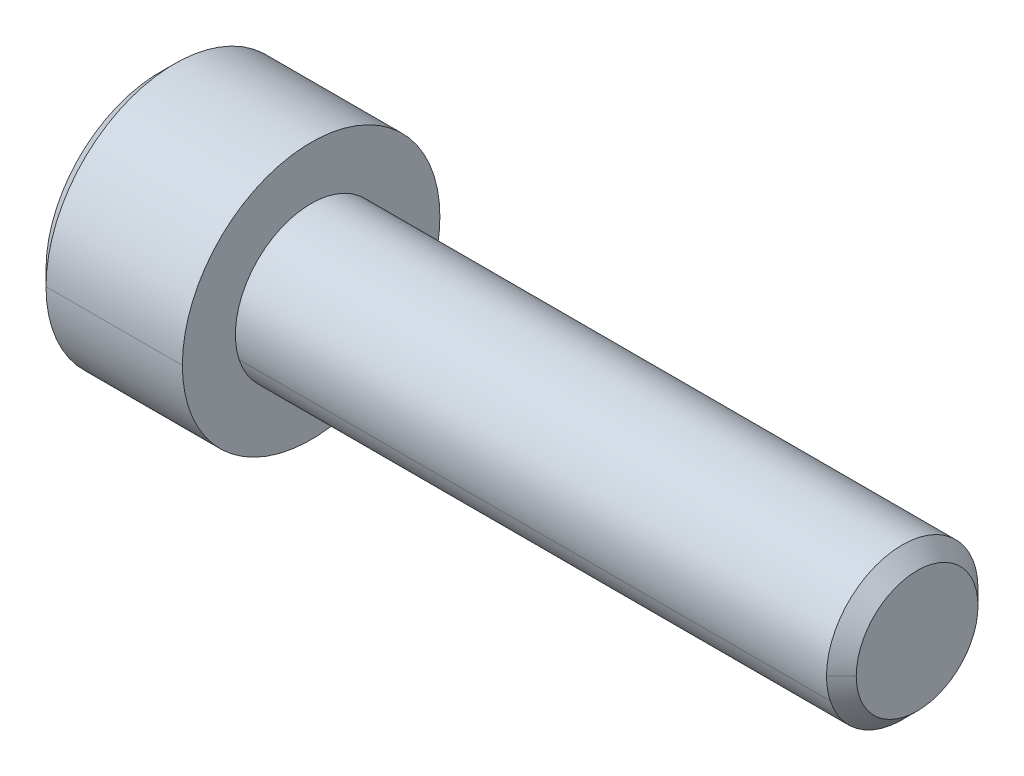
ISO-10303-21;
HEADER;
FILE_DESCRIPTION(('STEP AP214'),'2;1');
FILE_NAME('part.step','',(''),(''),'','','');
FILE_SCHEMA(('AUTOMOTIVE_DESIGN { 1 0 10303 214 1 1 1 1 }'));
ENDSEC;
DATA;
#1=APPLICATION_CONTEXT('core data for automotive mechanical design processes');
#2=APPLICATION_PROTOCOL_DEFINITION('international standard','automotive_design',2000,#1);
#3=PRODUCT_CONTEXT('',#1,'mechanical');
#4=PRODUCT('Part','Part','',(#3));
#5=PRODUCT_RELATED_PRODUCT_CATEGORY('part','',(#4));
#6=PRODUCT_DEFINITION_FORMATION('','',#4);
#7=PRODUCT_DEFINITION_CONTEXT('part definition',#1,'design');
#8=PRODUCT_DEFINITION('design','',#6,#7);
#9=PRODUCT_DEFINITION_SHAPE('','',#8);
#10=(LENGTH_UNIT() NAMED_UNIT(*) SI_UNIT(.MILLI.,.METRE.));
#11=(NAMED_UNIT(*) PLANE_ANGLE_UNIT() SI_UNIT($,.RADIAN.));
#12=(NAMED_UNIT(*) SI_UNIT($,.STERADIAN.) SOLID_ANGLE_UNIT());
#13=UNCERTAINTY_MEASURE_WITH_UNIT(LENGTH_MEASURE(1.E-05),#10,'distance_accuracy_value','');
#14=(GEOMETRIC_REPRESENTATION_CONTEXT(3) GLOBAL_UNCERTAINTY_ASSIGNED_CONTEXT((#13)) GLOBAL_UNIT_ASSIGNED_CONTEXT((#10,
#11,#12)) REPRESENTATION_CONTEXT('',''));
#15=CARTESIAN_POINT('',(0.,0.,0.));
#16=DIRECTION('',(0.,0.,1.));
#17=DIRECTION('',(1.,0.,0.));
#18=AXIS2_PLACEMENT_3D('',#15,#16,#17);
#19=CARTESIAN_POINT('',(-5.,0.,0.));
#20=DIRECTION('',(1.,0.,0.));
#21=DIRECTION('',(0.,0.,-1.));
#22=AXIS2_PLACEMENT_3D('',#19,#20,#21);
#23=PLANE('',#22);
#24=CARTESIAN_POINT('',(-5.,0.,0.));
#25=DIRECTION('',(1.,0.,0.));
#26=DIRECTION('',(0.,0.,-1.));
#27=AXIS2_PLACEMENT_3D('',#24,#25,#26);
#28=CIRCLE('',#27,3.75);
#29=CARTESIAN_POINT('',(-5.,0.,3.75));
#30=VERTEX_POINT('',#29);
#31=CARTESIAN_POINT('',(-5.,0.,-3.75));
#32=VERTEX_POINT('',#31);
#33=EDGE_CURVE('E11',#30,#32,#28,.T.);
#34=ORIENTED_EDGE('',*,*,#33,.F.);
#35=CARTESIAN_POINT('',(-5.,0.,0.));
#36=DIRECTION('',(1.,0.,0.));
#37=DIRECTION('',(0.,0.,-1.));
#38=AXIS2_PLACEMENT_3D('',#35,#36,#37);
#39=CIRCLE('',#38,3.75);
#40=EDGE_CURVE('E24',#32,#30,#39,.T.);
#41=ORIENTED_EDGE('',*,*,#40,.F.);
#42=EDGE_LOOP('',(#34,#41));
#43=FACE_BOUND('',#42,.T.);
#44=DIRECTION('',(0.,0.499999999999983,-0.866025403784448));
#45=VECTOR('',#44,1.);
#46=CARTESIAN_POINT('',(-5.,-2.3094010767585,0.));
#47=LINE('',#46,#45);
#48=CARTESIAN_POINT('',(-5.,-2.3094010767585,0.));
#49=VERTEX_POINT('',#48);
#50=CARTESIAN_POINT('',(-5.,-1.1547005383793,-2.));
#51=VERTEX_POINT('',#50);
#52=EDGE_CURVE('E360',#49,#51,#47,.T.);
#53=ORIENTED_EDGE('',*,*,#52,.T.);
#54=DIRECTION('',(0.,1.,0.));
#55=VECTOR('',#54,1.);
#56=CARTESIAN_POINT('',(-5.,-1.1547005383793,-2.));
#57=LINE('',#56,#55);
#58=CARTESIAN_POINT('',(-5.,1.1547005383793,-2.));
#59=VERTEX_POINT('',#58);
#60=EDGE_CURVE('E356',#51,#59,#57,.T.);
#61=ORIENTED_EDGE('',*,*,#60,.T.);
#62=DIRECTION('',(0.,0.499999999999983,0.866025403784448));
#63=VECTOR('',#62,1.);
#64=CARTESIAN_POINT('',(-5.,1.1547005383793,-2.));
#65=LINE('',#64,#63);
#66=CARTESIAN_POINT('',(-5.,2.3094010767585,0.));
#67=VERTEX_POINT('',#66);
#68=EDGE_CURVE('E352',#59,#67,#65,.T.);
#69=ORIENTED_EDGE('',*,*,#68,.T.);
#70=DIRECTION('',(0.,-0.499999999999983,0.866025403784448));
#71=VECTOR('',#70,1.);
#72=CARTESIAN_POINT('',(-5.,2.3094010767585,0.));
#73=LINE('',#72,#71);
#74=CARTESIAN_POINT('',(-5.,1.1547005383793,2.));
#75=VERTEX_POINT('',#74);
#76=EDGE_CURVE('E348',#67,#75,#73,.T.);
#77=ORIENTED_EDGE('',*,*,#76,.T.);
#78=DIRECTION('',(0.,-1.,0.));
#79=VECTOR('',#78,1.);
#80=CARTESIAN_POINT('',(-5.,1.1547005383793,2.));
#81=LINE('',#80,#79);
#82=CARTESIAN_POINT('',(-5.,-1.1547005383793,2.));
#83=VERTEX_POINT('',#82);
#84=EDGE_CURVE('E344',#75,#83,#81,.T.);
#85=ORIENTED_EDGE('',*,*,#84,.T.);
#86=DIRECTION('',(0.,-0.499999999999983,-0.866025403784448));
#87=VECTOR('',#86,1.);
#88=CARTESIAN_POINT('',(-5.,-1.1547005383793,2.));
#89=LINE('',#88,#87);
#90=EDGE_CURVE('E340',#83,#49,#89,.T.);
#91=ORIENTED_EDGE('',*,*,#90,.T.);
#92=EDGE_LOOP('',(#53,#61,#69,#77,#85,#91));
#93=FACE_BOUND('',#92,.T.);
#94=ADVANCED_FACE('F16',(#43,#93),#23,.F.);
#95=CARTESIAN_POINT('',(-2.5,-1.1547005383793,2.));
#96=DIRECTION('',(0.,0.866025403784448,-0.499999999999983));
#97=DIRECTION('',(0.,0.499999999999983,0.866025403784448));
#98=AXIS2_PLACEMENT_3D('',#95,#96,#97);
#99=PLANE('',#98);
#100=ORIENTED_EDGE('',*,*,#90,.F.);
#101=DIRECTION('',(-1.,0.,0.));
#102=VECTOR('',#101,1.);
#103=CARTESIAN_POINT('',(-2.5,-1.1547005383793,2.));
#104=LINE('',#103,#102);
#105=CARTESIAN_POINT('',(-2.5,-1.1547005383793,2.));
#106=VERTEX_POINT('',#105);
#107=EDGE_CURVE('E335',#106,#83,#104,.T.);
#108=ORIENTED_EDGE('',*,*,#107,.F.);
#109=DIRECTION('',(0.,-0.499999999999983,-0.866025403784448));
#110=VECTOR('',#109,1.);
#111=CARTESIAN_POINT('',(-2.5,-1.1547005383793,2.));
#112=LINE('',#111,#110);
#113=CARTESIAN_POINT('',(-2.5,-1.73205080756891,0.999999999999976));
#114=VERTEX_POINT('',#113);
#115=EDGE_CURVE('E331',#106,#114,#112,.T.);
#116=ORIENTED_EDGE('',*,*,#115,.T.);
#117=DIRECTION('',(0.,-0.499999999999983,-0.866025403784448));
#118=VECTOR('',#117,1.);
#119=CARTESIAN_POINT('',(-2.5,-1.1547005383793,2.));
#120=LINE('',#119,#118);
#121=CARTESIAN_POINT('',(-2.5,-2.3094010767585,0.));
#122=VERTEX_POINT('',#121);
#123=EDGE_CURVE('E327',#114,#122,#120,.T.);
#124=ORIENTED_EDGE('',*,*,#123,.T.);
#125=DIRECTION('',(-1.,0.,0.));
#126=VECTOR('',#125,1.);
#127=CARTESIAN_POINT('',(-2.5,-2.3094010767585,0.));
#128=LINE('',#127,#126);
#129=EDGE_CURVE('E322',#122,#49,#128,.T.);
#130=ORIENTED_EDGE('',*,*,#129,.T.);
#131=EDGE_LOOP('',(#100,#108,#116,#124,#130));
#132=FACE_BOUND('',#131,.T.);
#133=ADVANCED_FACE('F394',(#132),#99,.T.);
#134=CARTESIAN_POINT('',(-2.5,-2.3094010767585,0.));
#135=DIRECTION('',(0.,0.866025403784448,0.499999999999983));
#136=DIRECTION('',(0.,-0.499999999999983,0.866025403784448));
#137=AXIS2_PLACEMENT_3D('',#134,#135,#136);
#138=PLANE('',#137);
#139=ORIENTED_EDGE('',*,*,#52,.F.);
#140=ORIENTED_EDGE('',*,*,#129,.F.);
#141=DIRECTION('',(0.,0.499999999999983,-0.866025403784448));
#142=VECTOR('',#141,1.);
#143=CARTESIAN_POINT('',(-2.5,-2.3094010767585,0.));
#144=LINE('',#143,#142);
#145=CARTESIAN_POINT('',(-2.5,-1.73205080756889,-0.999999999999966));
#146=VERTEX_POINT('',#145);
#147=EDGE_CURVE('E318',#122,#146,#144,.T.);
#148=ORIENTED_EDGE('',*,*,#147,.T.);
#149=DIRECTION('',(0.,0.499999999999983,-0.866025403784448));
#150=VECTOR('',#149,1.);
#151=CARTESIAN_POINT('',(-2.5,-2.3094010767585,0.));
#152=LINE('',#151,#150);
#153=CARTESIAN_POINT('',(-2.5,-1.1547005383793,-2.));
#154=VERTEX_POINT('',#153);
#155=EDGE_CURVE('E314',#146,#154,#152,.T.);
#156=ORIENTED_EDGE('',*,*,#155,.T.);
#157=DIRECTION('',(-1.,0.,0.));
#158=VECTOR('',#157,1.);
#159=CARTESIAN_POINT('',(-2.5,-1.1547005383793,-2.));
#160=LINE('',#159,#158);
#161=EDGE_CURVE('E309',#154,#51,#160,.T.);
#162=ORIENTED_EDGE('',*,*,#161,.T.);
#163=EDGE_LOOP('',(#139,#140,#148,#156,#162));
#164=FACE_BOUND('',#163,.T.);
#165=ADVANCED_FACE('F398',(#164),#138,.T.);
#166=CARTESIAN_POINT('',(-2.5,-1.1547005383793,-2.));
#167=DIRECTION('',(0.,0.,1.));
#168=DIRECTION('',(1.,0.,0.));
#169=AXIS2_PLACEMENT_3D('',#166,#167,#168);
#170=PLANE('',#169);
#171=ORIENTED_EDGE('',*,*,#60,.F.);
#172=ORIENTED_EDGE('',*,*,#161,.F.);
#173=DIRECTION('',(0.,1.,0.));
#174=VECTOR('',#173,1.);
#175=CARTESIAN_POINT('',(-2.5,-1.1547005383793,-2.));
#176=LINE('',#175,#174);
#177=CARTESIAN_POINT('',(-2.5,0.,-2.));
#178=VERTEX_POINT('',#177);
#179=EDGE_CURVE('E305',#154,#178,#176,.T.);
#180=ORIENTED_EDGE('',*,*,#179,.T.);
#181=DIRECTION('',(0.,1.,0.));
#182=VECTOR('',#181,1.);
#183=CARTESIAN_POINT('',(-2.5,-1.1547005383793,-2.));
#184=LINE('',#183,#182);
#185=CARTESIAN_POINT('',(-2.5,1.1547005383793,-2.));
#186=VERTEX_POINT('',#185);
#187=EDGE_CURVE('E301',#178,#186,#184,.T.);
#188=ORIENTED_EDGE('',*,*,#187,.T.);
#189=DIRECTION('',(-1.,0.,0.));
#190=VECTOR('',#189,1.);
#191=CARTESIAN_POINT('',(-2.5,1.1547005383793,-2.));
#192=LINE('',#191,#190);
#193=EDGE_CURVE('E296',#186,#59,#192,.T.);
#194=ORIENTED_EDGE('',*,*,#193,.T.);
#195=EDGE_LOOP('',(#171,#172,#180,#188,#194));
#196=FACE_BOUND('',#195,.T.);
#197=ADVANCED_FACE('F410',(#196),#170,.T.);
#198=CARTESIAN_POINT('',(-2.5,1.1547005383793,-2.));
#199=DIRECTION('',(0.,-0.866025403784448,0.499999999999983));
#200=DIRECTION('',(0.,-0.499999999999983,-0.866025403784448));
#201=AXIS2_PLACEMENT_3D('',#198,#199,#200);
#202=PLANE('',#201);
#203=ORIENTED_EDGE('',*,*,#68,.F.);
#204=ORIENTED_EDGE('',*,*,#193,.F.);
#205=DIRECTION('',(0.,0.499999999999983,0.866025403784448));
#206=VECTOR('',#205,1.);
#207=CARTESIAN_POINT('',(-2.5,1.1547005383793,-2.));
#208=LINE('',#207,#206);
#209=CARTESIAN_POINT('',(-2.5,1.73205080756891,-0.999999999999976));
#210=VERTEX_POINT('',#209);
#211=EDGE_CURVE('E292',#186,#210,#208,.T.);
#212=ORIENTED_EDGE('',*,*,#211,.T.);
#213=DIRECTION('',(0.,0.499999999999983,0.866025403784448));
#214=VECTOR('',#213,1.);
#215=CARTESIAN_POINT('',(-2.5,1.1547005383793,-2.));
#216=LINE('',#215,#214);
#217=CARTESIAN_POINT('',(-2.5,2.3094010767585,0.));
#218=VERTEX_POINT('',#217);
#219=EDGE_CURVE('E288',#210,#218,#216,.T.);
#220=ORIENTED_EDGE('',*,*,#219,.T.);
#221=DIRECTION('',(-1.,0.,0.));
#222=VECTOR('',#221,1.);
#223=CARTESIAN_POINT('',(-2.5,2.3094010767585,0.));
#224=LINE('',#223,#222);
#225=EDGE_CURVE('E283',#218,#67,#224,.T.);
#226=ORIENTED_EDGE('',*,*,#225,.T.);
#227=EDGE_LOOP('',(#203,#204,#212,#220,#226));
#228=FACE_BOUND('',#227,.T.);
#229=ADVANCED_FACE('F416',(#228),#202,.T.);
#230=CARTESIAN_POINT('',(-2.5,2.3094010767585,0.));
#231=DIRECTION('',(0.,-0.866025403784448,-0.499999999999983));
#232=DIRECTION('',(0.,0.499999999999983,-0.866025403784448));
#233=AXIS2_PLACEMENT_3D('',#230,#231,#232);
#234=PLANE('',#233);
#235=ORIENTED_EDGE('',*,*,#76,.F.);
#236=ORIENTED_EDGE('',*,*,#225,.F.);
#237=DIRECTION('',(0.,-0.499999999999983,0.866025403784448));
#238=VECTOR('',#237,1.);
#239=CARTESIAN_POINT('',(-2.5,2.3094010767585,0.));
#240=LINE('',#239,#238);
#241=CARTESIAN_POINT('',(-2.5,1.73205080756891,0.999999999999976));
#242=VERTEX_POINT('',#241);
#243=EDGE_CURVE('E279',#218,#242,#240,.T.);
#244=ORIENTED_EDGE('',*,*,#243,.T.);
#245=DIRECTION('',(0.,-0.499999999999983,0.866025403784448));
#246=VECTOR('',#245,1.);
#247=CARTESIAN_POINT('',(-2.5,2.3094010767585,0.));
#248=LINE('',#247,#246);
#249=CARTESIAN_POINT('',(-2.5,1.1547005383793,2.));
#250=VERTEX_POINT('',#249);
#251=EDGE_CURVE('E275',#242,#250,#248,.T.);
#252=ORIENTED_EDGE('',*,*,#251,.T.);
#253=DIRECTION('',(-1.,0.,0.));
#254=VECTOR('',#253,1.);
#255=CARTESIAN_POINT('',(-2.5,1.1547005383793,2.));
#256=LINE('',#255,#254);
#257=EDGE_CURVE('E270',#250,#75,#256,.T.);
#258=ORIENTED_EDGE('',*,*,#257,.T.);
#259=EDGE_LOOP('',(#235,#236,#244,#252,#258));
#260=FACE_BOUND('',#259,.T.);
#261=ADVANCED_FACE('F422',(#260),#234,.T.);
#262=CARTESIAN_POINT('',(-2.5,1.1547005383793,2.));
#263=DIRECTION('',(0.,0.,-1.));
#264=DIRECTION('',(-1.,0.,0.));
#265=AXIS2_PLACEMENT_3D('',#262,#263,#264);
#266=PLANE('',#265);
#267=ORIENTED_EDGE('',*,*,#84,.F.);
#268=ORIENTED_EDGE('',*,*,#257,.F.);
#269=DIRECTION('',(0.,-1.,0.));
#270=VECTOR('',#269,1.);
#271=CARTESIAN_POINT('',(-2.5,1.1547005383793,2.));
#272=LINE('',#271,#270);
#273=CARTESIAN_POINT('',(-2.5,0.,2.));
#274=VERTEX_POINT('',#273);
#275=EDGE_CURVE('E266',#250,#274,#272,.T.);
#276=ORIENTED_EDGE('',*,*,#275,.T.);
#277=DIRECTION('',(0.,-1.,0.));
#278=VECTOR('',#277,1.);
#279=CARTESIAN_POINT('',(-2.5,1.1547005383793,2.));
#280=LINE('',#279,#278);
#281=EDGE_CURVE('E261',#274,#106,#280,.T.);
#282=ORIENTED_EDGE('',*,*,#281,.T.);
#283=ORIENTED_EDGE('',*,*,#107,.T.);
#284=EDGE_LOOP('',(#267,#268,#276,#282,#283));
#285=FACE_BOUND('',#284,.T.);
#286=ADVANCED_FACE('F426',(#285),#266,.T.);
#287=CARTESIAN_POINT('',(-2.5,0.,0.));
#288=DIRECTION('',(1.,0.,0.));
#289=DIRECTION('',(0.,0.,-1.));
#290=AXIS2_PLACEMENT_3D('',#287,#288,#289);
#291=PLANE('',#290);
#292=CARTESIAN_POINT('',(-2.5,0.,0.));
#293=DIRECTION('',(1.,0.,0.));
#294=DIRECTION('',(0.,0.,-1.));
#295=AXIS2_PLACEMENT_3D('',#292,#293,#294);
#296=CIRCLE('',#295,2.);
#297=EDGE_CURVE('E256',#274,#114,#296,.T.);
#298=ORIENTED_EDGE('',*,*,#297,.T.);
#299=ORIENTED_EDGE('',*,*,#115,.F.);
#300=ORIENTED_EDGE('',*,*,#281,.F.);
#301=EDGE_LOOP('',(#298,#299,#300));
#302=FACE_BOUND('',#301,.T.);
#303=ADVANCED_FACE('F467',(#302),#291,.F.);
#304=CARTESIAN_POINT('',(-2.5,0.,0.));
#305=DIRECTION('',(-1.,0.,0.));
#306=DIRECTION('',(0.,1.,0.));
#307=AXIS2_PLACEMENT_3D('',#304,#305,#306);
#308=CONICAL_SURFACE('',#307,2.,1.30899693899577);
#309=DIRECTION('',(-0.258819045102501,0.,-0.965925826289074));
#310=VECTOR('',#309,1.);
#311=CARTESIAN_POINT('',(-1.9641016151378,0.,0.));
#312=LINE('',#311,#310);
#313=CARTESIAN_POINT('',(-1.9641016151378,0.,0.));
#314=VERTEX_POINT('',#313);
#315=EDGE_CURVE('E251',#314,#178,#312,.T.);
#316=ORIENTED_EDGE('',*,*,#315,.T.);
#317=CARTESIAN_POINT('',(-2.5,0.,0.));
#318=DIRECTION('',(1.,0.,0.));
#319=DIRECTION('',(0.,0.,-1.));
#320=AXIS2_PLACEMENT_3D('',#317,#318,#319);
#321=CIRCLE('',#320,2.);
#322=EDGE_CURVE('E246',#146,#178,#321,.T.);
#323=ORIENTED_EDGE('',*,*,#322,.F.);
#324=CARTESIAN_POINT('',(-2.5,0.,0.));
#325=DIRECTION('',(1.,0.,0.));
#326=DIRECTION('',(0.,0.,-1.));
#327=AXIS2_PLACEMENT_3D('',#324,#325,#326);
#328=CIRCLE('',#327,2.);
#329=EDGE_CURVE('E241',#114,#146,#328,.T.);
#330=ORIENTED_EDGE('',*,*,#329,.F.);
#331=ORIENTED_EDGE('',*,*,#297,.F.);
#332=DIRECTION('',(-0.258819045102501,0.,0.965925826289074));
#333=VECTOR('',#332,1.);
#334=CARTESIAN_POINT('',(-1.9641016151378,0.,0.));
#335=LINE('',#334,#333);
#336=EDGE_CURVE('E236',#314,#274,#335,.T.);
#337=ORIENTED_EDGE('',*,*,#336,.F.);
#338=EDGE_LOOP('',(#316,#323,#330,#331,#337));
#339=FACE_BOUND('',#338,.T.);
#340=ADVANCED_FACE('F435',(#339),#308,.F.);
#341=CARTESIAN_POINT('',(-2.5,0.,0.));
#342=DIRECTION('',(-1.,0.,0.));
#343=DIRECTION('',(0.,-1.,0.));
#344=AXIS2_PLACEMENT_3D('',#341,#342,#343);
#345=CONICAL_SURFACE('',#344,2.,1.30899693899577);
#346=ORIENTED_EDGE('',*,*,#336,.T.);
#347=CARTESIAN_POINT('',(-2.5,0.,0.));
#348=DIRECTION('',(1.,0.,0.));
#349=DIRECTION('',(0.,0.,-1.));
#350=AXIS2_PLACEMENT_3D('',#347,#348,#349);
#351=CIRCLE('',#350,2.);
#352=EDGE_CURVE('E231',#242,#274,#351,.T.);
#353=ORIENTED_EDGE('',*,*,#352,.F.);
#354=CARTESIAN_POINT('',(-2.5,0.,0.));
#355=DIRECTION('',(1.,0.,0.));
#356=DIRECTION('',(0.,0.,-1.));
#357=AXIS2_PLACEMENT_3D('',#354,#355,#356);
#358=CIRCLE('',#357,2.);
#359=EDGE_CURVE('E226',#210,#242,#358,.T.);
#360=ORIENTED_EDGE('',*,*,#359,.F.);
#361=CARTESIAN_POINT('',(-2.5,0.,0.));
#362=DIRECTION('',(1.,0.,0.));
#363=DIRECTION('',(0.,0.,-1.));
#364=AXIS2_PLACEMENT_3D('',#361,#362,#363);
#365=CIRCLE('',#364,2.);
#366=EDGE_CURVE('E221',#178,#210,#365,.T.);
#367=ORIENTED_EDGE('',*,*,#366,.F.);
#368=ORIENTED_EDGE('',*,*,#315,.F.);
#369=EDGE_LOOP('',(#346,#353,#360,#367,#368));
#370=FACE_BOUND('',#369,.T.);
#371=ADVANCED_FACE('F460',(#370),#345,.F.);
#372=CARTESIAN_POINT('',(-2.5,0.,0.));
#373=DIRECTION('',(1.,0.,0.));
#374=DIRECTION('',(0.,0.,-1.));
#375=AXIS2_PLACEMENT_3D('',#372,#373,#374);
#376=PLANE('',#375);
#377=ORIENTED_EDGE('',*,*,#366,.T.);
#378=ORIENTED_EDGE('',*,*,#211,.F.);
#379=ORIENTED_EDGE('',*,*,#187,.F.);
#380=EDGE_LOOP('',(#377,#378,#379));
#381=FACE_BOUND('',#380,.T.);
#382=ADVANCED_FACE('F456',(#381),#376,.F.);
#383=CARTESIAN_POINT('',(-2.5,0.,0.));
#384=DIRECTION('',(1.,0.,0.));
#385=DIRECTION('',(0.,0.,-1.));
#386=AXIS2_PLACEMENT_3D('',#383,#384,#385);
#387=PLANE('',#386);
#388=ORIENTED_EDGE('',*,*,#219,.F.);
#389=ORIENTED_EDGE('',*,*,#359,.T.);
#390=ORIENTED_EDGE('',*,*,#243,.F.);
#391=EDGE_LOOP('',(#388,#389,#390));
#392=FACE_BOUND('',#391,.T.);
#393=ADVANCED_FACE('F449',(#392),#387,.F.);
#394=CARTESIAN_POINT('',(-2.5,0.,0.));
#395=DIRECTION('',(1.,0.,0.));
#396=DIRECTION('',(0.,0.,-1.));
#397=AXIS2_PLACEMENT_3D('',#394,#395,#396);
#398=PLANE('',#397);
#399=ORIENTED_EDGE('',*,*,#352,.T.);
#400=ORIENTED_EDGE('',*,*,#275,.F.);
#401=ORIENTED_EDGE('',*,*,#251,.F.);
#402=EDGE_LOOP('',(#399,#400,#401));
#403=FACE_BOUND('',#402,.T.);
#404=ADVANCED_FACE('F442',(#403),#398,.F.);
#405=CARTESIAN_POINT('',(-2.5,0.,0.));
#406=DIRECTION('',(1.,0.,0.));
#407=DIRECTION('',(0.,0.,-1.));
#408=AXIS2_PLACEMENT_3D('',#405,#406,#407);
#409=PLANE('',#408);
#410=ORIENTED_EDGE('',*,*,#329,.T.);
#411=ORIENTED_EDGE('',*,*,#147,.F.);
#412=ORIENTED_EDGE('',*,*,#123,.F.);
#413=EDGE_LOOP('',(#410,#411,#412));
#414=FACE_BOUND('',#413,.T.);
#415=ADVANCED_FACE('F440',(#414),#409,.F.);
#416=CARTESIAN_POINT('',(-2.5,0.,0.));
#417=DIRECTION('',(1.,0.,0.));
#418=DIRECTION('',(0.,0.,-1.));
#419=AXIS2_PLACEMENT_3D('',#416,#417,#418);
#420=PLANE('',#419);
#421=ORIENTED_EDGE('',*,*,#322,.T.);
#422=ORIENTED_EDGE('',*,*,#179,.F.);
#423=ORIENTED_EDGE('',*,*,#155,.F.);
#424=EDGE_LOOP('',(#421,#422,#423));
#425=FACE_BOUND('',#424,.T.);
#426=ADVANCED_FACE('F439',(#425),#420,.F.);
#427=CARTESIAN_POINT('',(-5.,0.,0.));
#428=DIRECTION('',(1.,0.,0.));
#429=DIRECTION('',(0.,-1.,0.));
#430=AXIS2_PLACEMENT_3D('',#427,#428,#429);
#431=CONICAL_SURFACE('',#430,3.75,0.785398163397448);
#432=DIRECTION('',(0.707106781186548,0.,0.707106781186548));
#433=VECTOR('',#432,1.);
#434=CARTESIAN_POINT('',(-5.,0.,3.75));
#435=LINE('',#434,#433);
#436=CARTESIAN_POINT('',(-4.5,0.,4.25));
#437=VERTEX_POINT('',#436);
#438=EDGE_CURVE('E217',#30,#437,#435,.T.);
#439=ORIENTED_EDGE('',*,*,#438,.T.);
#440=CARTESIAN_POINT('',(-4.5,0.,0.));
#441=DIRECTION('',(1.,0.,0.));
#442=DIRECTION('',(0.,0.,-1.));
#443=AXIS2_PLACEMENT_3D('',#440,#441,#442);
#444=CIRCLE('',#443,4.25);
#445=CARTESIAN_POINT('',(-4.5,0.,-4.25));
#446=VERTEX_POINT('',#445);
#447=EDGE_CURVE('E212',#446,#437,#444,.T.);
#448=ORIENTED_EDGE('',*,*,#447,.F.);
#449=DIRECTION('',(0.707106781186548,0.,-0.707106781186548));
#450=VECTOR('',#449,1.);
#451=CARTESIAN_POINT('',(-5.,0.,-3.75));
#452=LINE('',#451,#450);
#453=EDGE_CURVE('E207',#32,#446,#452,.T.);
#454=ORIENTED_EDGE('',*,*,#453,.F.);
#455=ORIENTED_EDGE('',*,*,#40,.T.);
#456=EDGE_LOOP('',(#439,#448,#454,#455));
#457=FACE_BOUND('',#456,.T.);
#458=ADVANCED_FACE('F369',(#457),#431,.T.);
#459=CARTESIAN_POINT('',(-5.,0.,0.));
#460=DIRECTION('',(1.,0.,0.));
#461=DIRECTION('',(0.,1.,0.));
#462=AXIS2_PLACEMENT_3D('',#459,#460,#461);
#463=CONICAL_SURFACE('',#462,3.75,0.785398163397448);
#464=ORIENTED_EDGE('',*,*,#438,.F.);
#465=ORIENTED_EDGE('',*,*,#33,.T.);
#466=ORIENTED_EDGE('',*,*,#453,.T.);
#467=CARTESIAN_POINT('',(-4.5,0.,0.));
#468=DIRECTION('',(1.,0.,0.));
#469=DIRECTION('',(0.,0.,-1.));
#470=AXIS2_PLACEMENT_3D('',#467,#468,#469);
#471=CIRCLE('',#470,4.25);
#472=EDGE_CURVE('E202',#437,#446,#471,.T.);
#473=ORIENTED_EDGE('',*,*,#472,.F.);
#474=EDGE_LOOP('',(#464,#465,#466,#473));
#475=FACE_BOUND('',#474,.T.);
#476=ADVANCED_FACE('F372',(#475),#463,.T.);
#477=CARTESIAN_POINT('',(20.,0.,0.));
#478=DIRECTION('',(1.,0.,0.));
#479=DIRECTION('',(0.,1.,0.));
#480=AXIS2_PLACEMENT_3D('',#477,#478,#479);
#481=CYLINDRICAL_SURFACE('',#480,4.25);
#482=DIRECTION('',(1.,0.,0.));
#483=VECTOR('',#482,1.);
#484=CARTESIAN_POINT('',(-4.5,0.,4.25));
#485=LINE('',#484,#483);
#486=CARTESIAN_POINT('',(0.,0.,4.25));
#487=VERTEX_POINT('',#486);
#488=EDGE_CURVE('E197',#437,#487,#485,.T.);
#489=ORIENTED_EDGE('',*,*,#488,.F.);
#490=ORIENTED_EDGE('',*,*,#472,.T.);
#491=DIRECTION('',(1.,0.,0.));
#492=VECTOR('',#491,1.);
#493=CARTESIAN_POINT('',(-4.5,0.,-4.25));
#494=LINE('',#493,#492);
#495=CARTESIAN_POINT('',(0.,0.,-4.25));
#496=VERTEX_POINT('',#495);
#497=EDGE_CURVE('E193',#446,#496,#494,.T.);
#498=ORIENTED_EDGE('',*,*,#497,.T.);
#499=CARTESIAN_POINT('',(0.,0.,0.));
#500=DIRECTION('',(1.,0.,0.));
#501=DIRECTION('',(0.,0.,-1.));
#502=AXIS2_PLACEMENT_3D('',#499,#500,#501);
#503=CIRCLE('',#502,4.25);
#504=EDGE_CURVE('E188',#487,#496,#503,.T.);
#505=ORIENTED_EDGE('',*,*,#504,.F.);
#506=EDGE_LOOP('',(#489,#490,#498,#505));
#507=FACE_BOUND('',#506,.T.);
#508=ADVANCED_FACE('F376',(#507),#481,.T.);
#509=CARTESIAN_POINT('',(0.,4.25,0.));
#510=DIRECTION('',(-1.,0.,0.));
#511=DIRECTION('',(0.,0.,1.));
#512=AXIS2_PLACEMENT_3D('',#509,#510,#511);
#513=PLANE('',#512);
#514=CARTESIAN_POINT('',(0.,0.,0.));
#515=DIRECTION('',(1.,0.,0.));
#516=DIRECTION('',(0.,0.,-1.));
#517=AXIS2_PLACEMENT_3D('',#514,#515,#516);
#518=CIRCLE('',#517,2.5);
#519=CARTESIAN_POINT('',(0.,-0.772542485937367,2.37764129073788));
#520=VERTEX_POINT('',#519);
#521=CARTESIAN_POINT('',(0.,0.,-2.5));
#522=VERTEX_POINT('',#521);
#523=EDGE_CURVE('E183',#520,#522,#518,.T.);
#524=ORIENTED_EDGE('',*,*,#523,.F.);
#525=CARTESIAN_POINT('',(0.,0.,0.));
#526=DIRECTION('',(1.,0.,0.));
#527=DIRECTION('',(0.,0.,-1.));
#528=AXIS2_PLACEMENT_3D('',#525,#526,#527);
#529=CIRCLE('',#528,2.5);
#530=EDGE_CURVE('E178',#522,#520,#529,.T.);
#531=ORIENTED_EDGE('',*,*,#530,.F.);
#532=EDGE_LOOP('',(#524,#531));
#533=FACE_BOUND('',#532,.T.);
#534=CARTESIAN_POINT('',(0.,0.,0.));
#535=DIRECTION('',(1.,0.,0.));
#536=DIRECTION('',(0.,0.,-1.));
#537=AXIS2_PLACEMENT_3D('',#534,#535,#536);
#538=CIRCLE('',#537,4.25);
#539=EDGE_CURVE('E173',#496,#487,#538,.T.);
#540=ORIENTED_EDGE('',*,*,#539,.T.);
#541=ORIENTED_EDGE('',*,*,#504,.T.);
#542=EDGE_LOOP('',(#540,#541));
#543=FACE_BOUND('',#542,.T.);
#544=ADVANCED_FACE('F381',(#533,#543),#513,.F.);
#545=CARTESIAN_POINT('',(20.,0.,0.));
#546=DIRECTION('',(1.,0.,0.));
#547=DIRECTION('',(0.,-1.,0.));
#548=AXIS2_PLACEMENT_3D('',#545,#546,#547);
#549=CYLINDRICAL_SURFACE('',#548,4.25);
#550=ORIENTED_EDGE('',*,*,#488,.T.);
#551=ORIENTED_EDGE('',*,*,#539,.F.);
#552=ORIENTED_EDGE('',*,*,#497,.F.);
#553=ORIENTED_EDGE('',*,*,#447,.T.);
#554=EDGE_LOOP('',(#550,#551,#552,#553));
#555=FACE_BOUND('',#554,.T.);
#556=ADVANCED_FACE('F379',(#555),#549,.T.);
#557=CARTESIAN_POINT('',(20.,0.,0.));
#558=DIRECTION('',(1.,0.,0.));
#559=DIRECTION('',(0.,-0.987688340595138,-0.156434465040231));
#560=AXIS2_PLACEMENT_3D('',#557,#558,#559);
#561=CYLINDRICAL_SURFACE('',#560,2.5);
#562=DIRECTION('',(1.,0.,0.));
#563=VECTOR('',#562,1.);
#564=CARTESIAN_POINT('',(0.,-0.772542485937367,2.37764129073788));
#565=LINE('',#564,#563);
#566=CARTESIAN_POINT('',(19.5095,-0.772542485937367,2.37764129073788));
#567=VERTEX_POINT('',#566);
#568=EDGE_CURVE('E169',#520,#567,#565,.T.);
#569=ORIENTED_EDGE('',*,*,#568,.T.);
#570=CARTESIAN_POINT('',(19.5095,0.,0.));
#571=DIRECTION('',(1.,0.,0.));
#572=DIRECTION('',(0.,0.,-1.));
#573=AXIS2_PLACEMENT_3D('',#570,#571,#572);
#574=CIRCLE('',#573,2.5);
#575=CARTESIAN_POINT('',(19.5095,0.,2.5));
#576=VERTEX_POINT('',#575);
#577=EDGE_CURVE('E165',#576,#567,#574,.T.);
#578=ORIENTED_EDGE('',*,*,#577,.F.);
#579=CARTESIAN_POINT('',(19.5095,0.,0.));
#580=DIRECTION('',(1.,0.,0.));
#581=DIRECTION('',(0.,0.,-1.));
#582=AXIS2_PLACEMENT_3D('',#579,#580,#581);
#583=CIRCLE('',#582,2.5);
#584=CARTESIAN_POINT('',(19.5095,0.,-2.5));
#585=VERTEX_POINT('',#584);
#586=EDGE_CURVE('E143',#585,#576,#583,.T.);
#587=ORIENTED_EDGE('',*,*,#586,.F.);
#588=DIRECTION('',(1.,0.,0.));
#589=VECTOR('',#588,1.);
#590=CARTESIAN_POINT('',(0.,0.,-2.5));
#591=LINE('',#590,#589);
#592=EDGE_CURVE('E157',#522,#585,#591,.T.);
#593=ORIENTED_EDGE('',*,*,#592,.F.);
#594=ORIENTED_EDGE('',*,*,#530,.T.);
#595=EDGE_LOOP('',(#569,#578,#587,#593,#594));
#596=FACE_BOUND('',#595,.T.);
#597=ADVANCED_FACE('F390',(#596),#561,.T.);
#598=CARTESIAN_POINT('',(20.,0.,0.));
#599=DIRECTION('',(1.,0.,0.));
#600=DIRECTION('',(0.,0.987688340595138,0.156434465040231));
#601=AXIS2_PLACEMENT_3D('',#598,#599,#600);
#602=CYLINDRICAL_SURFACE('',#601,2.5);
#603=ORIENTED_EDGE('',*,*,#568,.F.);
#604=ORIENTED_EDGE('',*,*,#523,.T.);
#605=ORIENTED_EDGE('',*,*,#592,.T.);
#606=CARTESIAN_POINT('',(19.5095,0.,0.));
#607=DIRECTION('',(1.,0.,0.));
#608=DIRECTION('',(0.,0.,-1.));
#609=AXIS2_PLACEMENT_3D('',#606,#607,#608);
#610=CIRCLE('',#609,2.5);
#611=EDGE_CURVE('E153',#567,#585,#610,.T.);
#612=ORIENTED_EDGE('',*,*,#611,.F.);
#613=EDGE_LOOP('',(#603,#604,#605,#612));
#614=FACE_BOUND('',#613,.T.);
#615=ADVANCED_FACE('F588',(#614),#602,.T.);
#616=CARTESIAN_POINT('',(19.5095,0.,0.));
#617=DIRECTION('',(-1.,0.,0.));
#618=DIRECTION('',(0.,1.,0.));
#619=AXIS2_PLACEMENT_3D('',#616,#617,#618);
#620=CONICAL_SURFACE('',#619,2.5,0.785398163397447);
#621=DIRECTION('',(-0.707106781186548,0.,-0.707106781186547));
#622=VECTOR('',#621,1.);
#623=CARTESIAN_POINT('',(20.,0.,-2.0095));
#624=LINE('',#623,#622);
#625=CARTESIAN_POINT('',(20.,0.,-2.0095));
#626=VERTEX_POINT('',#625);
#627=EDGE_CURVE('E134',#626,#585,#624,.T.);
#628=ORIENTED_EDGE('',*,*,#627,.F.);
#629=CARTESIAN_POINT('',(20.,0.,0.));
#630=DIRECTION('',(1.,0.,0.));
#631=DIRECTION('',(0.,0.,-1.));
#632=AXIS2_PLACEMENT_3D('',#629,#630,#631);
#633=CIRCLE('',#632,2.0095);
#634=CARTESIAN_POINT('',(20.,0.,2.0095));
#635=VERTEX_POINT('',#634);
#636=EDGE_CURVE('E125',#635,#626,#633,.T.);
#637=ORIENTED_EDGE('',*,*,#636,.F.);
#638=DIRECTION('',(-0.707106781186548,0.,0.707106781186547));
#639=VECTOR('',#638,1.);
#640=CARTESIAN_POINT('',(20.,0.,2.0095));
#641=LINE('',#640,#639);
#642=EDGE_CURVE('E130',#635,#576,#641,.T.);
#643=ORIENTED_EDGE('',*,*,#642,.T.);
#644=ORIENTED_EDGE('',*,*,#577,.T.);
#645=ORIENTED_EDGE('',*,*,#611,.T.);
#646=EDGE_LOOP('',(#628,#637,#643,#644,#645));
#647=FACE_BOUND('',#646,.T.);
#648=ADVANCED_FACE('F127',(#647),#620,.T.);
#649=CARTESIAN_POINT('',(19.5095,0.,0.));
#650=DIRECTION('',(-1.,0.,0.));
#651=DIRECTION('',(0.,-1.,0.));
#652=AXIS2_PLACEMENT_3D('',#649,#650,#651);
#653=CONICAL_SURFACE('',#652,2.5,0.785398163397447);
#654=ORIENTED_EDGE('',*,*,#627,.T.);
#655=ORIENTED_EDGE('',*,*,#586,.T.);
#656=ORIENTED_EDGE('',*,*,#642,.F.);
#657=CARTESIAN_POINT('',(20.,0.,0.));
#658=DIRECTION('',(1.,0.,0.));
#659=DIRECTION('',(0.,0.,-1.));
#660=AXIS2_PLACEMENT_3D('',#657,#658,#659);
#661=CIRCLE('',#660,2.0095);
#662=EDGE_CURVE('E138',#626,#635,#661,.T.);
#663=ORIENTED_EDGE('',*,*,#662,.F.);
#664=EDGE_LOOP('',(#654,#655,#656,#663));
#665=FACE_BOUND('',#664,.T.);
#666=ADVANCED_FACE('F142',(#665),#653,.T.);
#667=CARTESIAN_POINT('',(20.,2.0095,0.));
#668=DIRECTION('',(-1.,0.,0.));
#669=DIRECTION('',(0.,0.,1.));
#670=AXIS2_PLACEMENT_3D('',#667,#668,#669);
#671=PLANE('',#670);
#672=ORIENTED_EDGE('',*,*,#662,.T.);
#673=ORIENTED_EDGE('',*,*,#636,.T.);
#674=EDGE_LOOP('',(#672,#673));
#675=FACE_BOUND('',#674,.T.);
#676=ADVANCED_FACE('F139',(#675),#671,.F.);
#677=CLOSED_SHELL('',(#94,#133,#165,#197,#229,#261,#286,#303,#340,#371,#382,#393,#404,#415,#426,
#458,#476,#508,#544,#556,#597,#615,#648,#666,#676));
#678=MANIFOLD_SOLID_BREP('B1',#677);
#679=ADVANCED_BREP_SHAPE_REPRESENTATION('',(#18,#678),#14);
#680=SHAPE_DEFINITION_REPRESENTATION(#9,#679);
ENDSEC;
END-ISO-10303-21;
